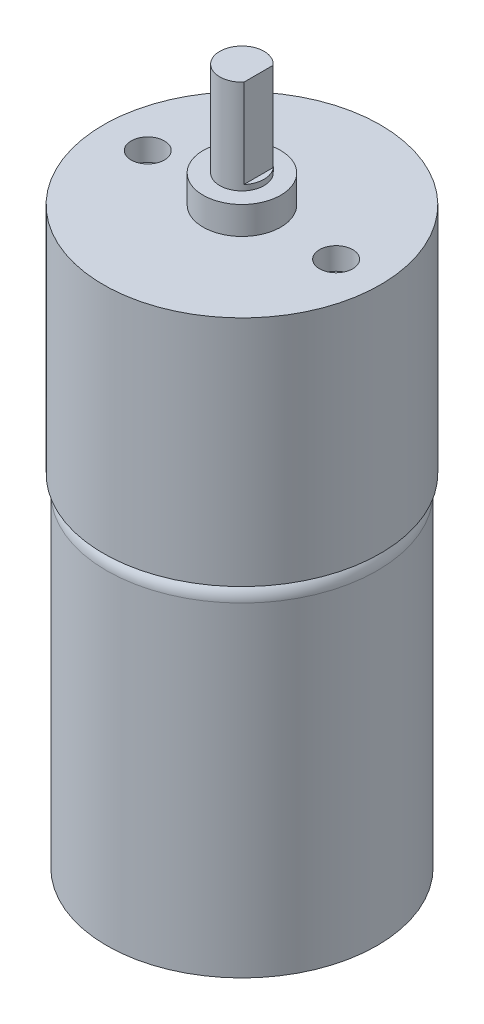
ISO-10303-21;
HEADER;
FILE_DESCRIPTION(('STEP AP214'),'2;1');
FILE_NAME('part.step','',(''),(''),'','','');
FILE_SCHEMA(('AUTOMOTIVE_DESIGN { 1 0 10303 214 1 1 1 1 }'));
ENDSEC;
DATA;
#1=APPLICATION_CONTEXT('core data for automotive mechanical design processes');
#2=APPLICATION_PROTOCOL_DEFINITION('international standard','automotive_design',2000,#1);
#3=PRODUCT_CONTEXT('',#1,'mechanical');
#4=PRODUCT('Part','Part','',(#3));
#5=PRODUCT_RELATED_PRODUCT_CATEGORY('part','',(#4));
#6=PRODUCT_DEFINITION_FORMATION('','',#4);
#7=PRODUCT_DEFINITION_CONTEXT('part definition',#1,'design');
#8=PRODUCT_DEFINITION('design','',#6,#7);
#9=PRODUCT_DEFINITION_SHAPE('','',#8);
#10=(LENGTH_UNIT() NAMED_UNIT(*) SI_UNIT(.MILLI.,.METRE.));
#11=(NAMED_UNIT(*) PLANE_ANGLE_UNIT() SI_UNIT($,.RADIAN.));
#12=(NAMED_UNIT(*) SI_UNIT($,.STERADIAN.) SOLID_ANGLE_UNIT());
#13=UNCERTAINTY_MEASURE_WITH_UNIT(LENGTH_MEASURE(1.E-05),#10,'distance_accuracy_value','');
#14=(GEOMETRIC_REPRESENTATION_CONTEXT(3) GLOBAL_UNCERTAINTY_ASSIGNED_CONTEXT((#13)) GLOBAL_UNIT_ASSIGNED_CONTEXT((#10,
#11,#12)) REPRESENTATION_CONTEXT('',''));
#15=CARTESIAN_POINT('',(0.,0.,0.));
#16=DIRECTION('',(0.,0.,1.));
#17=DIRECTION('',(1.,0.,0.));
#18=AXIS2_PLACEMENT_3D('',#15,#16,#17);
#19=CARTESIAN_POINT('',(0.,0.,0.));
#20=DIRECTION('',(0.,-1.,0.));
#21=DIRECTION('',(0.,0.,-1.));
#22=AXIS2_PLACEMENT_3D('',#19,#20,#21);
#23=PLANE('',#22);
#24=CARTESIAN_POINT('',(0.,0.,0.));
#25=DIRECTION('',(0.,-1.,0.));
#26=DIRECTION('',(0.,0.,-1.));
#27=AXIS2_PLACEMENT_3D('',#24,#25,#26);
#28=CIRCLE('',#27,3.25);
#29=CARTESIAN_POINT('',(0.,0.,-3.25));
#30=VERTEX_POINT('',#29);
#31=EDGE_CURVE('E11',#30,#30,#28,.T.);
#32=ORIENTED_EDGE('',*,*,#31,.T.);
#33=EDGE_LOOP('',(#32));
#34=FACE_BOUND('',#33,.T.);
#35=ADVANCED_FACE('F33',(#34),#23,.T.);
#36=CARTESIAN_POINT('',(0.,0.,0.));
#37=DIRECTION('',(0.,-1.,0.));
#38=DIRECTION('',(0.,0.,-1.));
#39=AXIS2_PLACEMENT_3D('',#36,#37,#38);
#40=CYLINDRICAL_SURFACE('',#39,3.25);
#41=CARTESIAN_POINT('',(0.,2.,0.));
#42=DIRECTION('',(0.,-1.,0.));
#43=DIRECTION('',(0.,0.,-1.));
#44=AXIS2_PLACEMENT_3D('',#41,#42,#43);
#45=CIRCLE('',#44,3.25);
#46=CARTESIAN_POINT('',(0.,2.,-3.25));
#47=VERTEX_POINT('',#46);
#48=EDGE_CURVE('E40',#47,#47,#45,.T.);
#49=ORIENTED_EDGE('',*,*,#48,.T.);
#50=EDGE_LOOP('',(#49));
#51=FACE_BOUND('',#50,.T.);
#52=ORIENTED_EDGE('',*,*,#31,.F.);
#53=EDGE_LOOP('',(#52));
#54=FACE_BOUND('',#53,.T.);
#55=ADVANCED_FACE('F102',(#51,#54),#40,.T.);
#56=CARTESIAN_POINT('',(3.25,2.,0.));
#57=DIRECTION('',(0.,-1.,0.));
#58=DIRECTION('',(0.,0.,-1.));
#59=AXIS2_PLACEMENT_3D('',#56,#57,#58);
#60=PLANE('',#59);
#61=CARTESIAN_POINT('',(0.,2.,0.));
#62=DIRECTION('',(0.,-1.,0.));
#63=DIRECTION('',(0.,0.,-1.));
#64=AXIS2_PLACEMENT_3D('',#61,#62,#63);
#65=CIRCLE('',#64,12.2);
#66=CARTESIAN_POINT('',(0.,2.,-12.2));
#67=VERTEX_POINT('',#66);
#68=EDGE_CURVE('E97',#67,#67,#65,.T.);
#69=ORIENTED_EDGE('',*,*,#68,.T.);
#70=EDGE_LOOP('',(#69));
#71=FACE_BOUND('',#70,.T.);
#72=ORIENTED_EDGE('',*,*,#48,.F.);
#73=EDGE_LOOP('',(#72));
#74=FACE_BOUND('',#73,.T.);
#75=ADVANCED_FACE('F105',(#71,#74),#60,.T.);
#76=CARTESIAN_POINT('',(0.,0.,0.));
#77=DIRECTION('',(0.,-1.,0.));
#78=DIRECTION('',(0.,0.,-1.));
#79=AXIS2_PLACEMENT_3D('',#76,#77,#78);
#80=CYLINDRICAL_SURFACE('',#79,12.2);
#81=CARTESIAN_POINT('',(0.,31.3,0.));
#82=DIRECTION('',(0.,-1.,0.));
#83=DIRECTION('',(0.,0.,-1.));
#84=AXIS2_PLACEMENT_3D('',#81,#82,#83);
#85=CIRCLE('',#84,12.2);
#86=CARTESIAN_POINT('',(0.,31.3,-12.2));
#87=VERTEX_POINT('',#86);
#88=EDGE_CURVE('E94',#87,#87,#85,.T.);
#89=ORIENTED_EDGE('',*,*,#88,.T.);
#90=EDGE_LOOP('',(#89));
#91=FACE_BOUND('',#90,.T.);
#92=ORIENTED_EDGE('',*,*,#68,.F.);
#93=EDGE_LOOP('',(#92));
#94=FACE_BOUND('',#93,.T.);
#95=ADVANCED_FACE('F107',(#91,#94),#80,.T.);
#96=CARTESIAN_POINT('',(0.,31.3,0.));
#97=DIRECTION('',(0.,-1.,0.));
#98=DIRECTION('',(0.,0.,-1.));
#99=AXIS2_PLACEMENT_3D('',#96,#97,#98);
#100=TOROIDAL_SURFACE('',#99,10.7,1.5);
#101=CARTESIAN_POINT('',(0.,32.8,0.));
#102=DIRECTION('',(0.,-1.,0.));
#103=DIRECTION('',(0.,0.,-1.));
#104=AXIS2_PLACEMENT_3D('',#101,#102,#103);
#105=CIRCLE('',#104,10.7);
#106=CARTESIAN_POINT('',(0.,32.8,-10.7));
#107=VERTEX_POINT('',#106);
#108=EDGE_CURVE('E91',#107,#107,#105,.T.);
#109=ORIENTED_EDGE('',*,*,#108,.T.);
#110=EDGE_LOOP('',(#109));
#111=FACE_BOUND('',#110,.T.);
#112=ORIENTED_EDGE('',*,*,#88,.F.);
#113=EDGE_LOOP('',(#112));
#114=FACE_BOUND('',#113,.T.);
#115=ADVANCED_FACE('F114',(#111,#114),#100,.T.);
#116=CARTESIAN_POINT('',(10.7,32.8,0.));
#117=DIRECTION('',(0.,-1.,0.));
#118=DIRECTION('',(0.,0.,-1.));
#119=AXIS2_PLACEMENT_3D('',#116,#117,#118);
#120=PLANE('',#119);
#121=CARTESIAN_POINT('',(0.,32.8,0.));
#122=DIRECTION('',(0.,-1.,0.));
#123=DIRECTION('',(0.,0.,-1.));
#124=AXIS2_PLACEMENT_3D('',#121,#122,#123);
#125=CIRCLE('',#124,12.5);
#126=CARTESIAN_POINT('',(0.,32.8,-12.5));
#127=VERTEX_POINT('',#126);
#128=EDGE_CURVE('E88',#127,#127,#125,.T.);
#129=ORIENTED_EDGE('',*,*,#128,.T.);
#130=EDGE_LOOP('',(#129));
#131=FACE_BOUND('',#130,.T.);
#132=ORIENTED_EDGE('',*,*,#108,.F.);
#133=EDGE_LOOP('',(#132));
#134=FACE_BOUND('',#133,.T.);
#135=ADVANCED_FACE('F145',(#131,#134),#120,.T.);
#136=CARTESIAN_POINT('',(0.,0.,0.));
#137=DIRECTION('',(0.,-1.,0.));
#138=DIRECTION('',(0.,0.,-1.));
#139=AXIS2_PLACEMENT_3D('',#136,#137,#138);
#140=CYLINDRICAL_SURFACE('',#139,12.5);
#141=CARTESIAN_POINT('',(0.,53.8,0.));
#142=DIRECTION('',(0.,-1.,0.));
#143=DIRECTION('',(0.,0.,-1.));
#144=AXIS2_PLACEMENT_3D('',#141,#142,#143);
#145=CIRCLE('',#144,12.5);
#146=CARTESIAN_POINT('',(0.,53.8,-12.5));
#147=VERTEX_POINT('',#146);
#148=EDGE_CURVE('E85',#147,#147,#145,.T.);
#149=ORIENTED_EDGE('',*,*,#148,.T.);
#150=EDGE_LOOP('',(#149));
#151=FACE_BOUND('',#150,.T.);
#152=ORIENTED_EDGE('',*,*,#128,.F.);
#153=EDGE_LOOP('',(#152));
#154=FACE_BOUND('',#153,.T.);
#155=ADVANCED_FACE('F155',(#151,#154),#140,.T.);
#156=CARTESIAN_POINT('',(12.5,53.8,0.));
#157=DIRECTION('',(0.,1.,0.));
#158=DIRECTION('',(0.,0.,1.));
#159=AXIS2_PLACEMENT_3D('',#156,#157,#158);
#160=PLANE('',#159);
#161=CARTESIAN_POINT('',(8.5,53.8,0.));
#162=DIRECTION('',(0.,1.,0.));
#163=DIRECTION('',(0.,0.,1.));
#164=AXIS2_PLACEMENT_3D('',#161,#162,#163);
#165=CIRCLE('',#164,1.5);
#166=CARTESIAN_POINT('',(8.5,53.8,1.5));
#167=VERTEX_POINT('',#166);
#168=EDGE_CURVE('E273',#167,#167,#165,.T.);
#169=ORIENTED_EDGE('',*,*,#168,.F.);
#170=EDGE_LOOP('',(#169));
#171=FACE_BOUND('',#170,.T.);
#172=CARTESIAN_POINT('',(-8.5,53.8,0.));
#173=DIRECTION('',(0.,1.,0.));
#174=DIRECTION('',(0.,0.,-1.));
#175=AXIS2_PLACEMENT_3D('',#172,#173,#174);
#176=CIRCLE('',#175,1.5);
#177=CARTESIAN_POINT('',(-8.5,53.8,-1.5));
#178=VERTEX_POINT('',#177);
#179=EDGE_CURVE('E281',#178,#178,#176,.T.);
#180=ORIENTED_EDGE('',*,*,#179,.F.);
#181=EDGE_LOOP('',(#180));
#182=FACE_BOUND('',#181,.T.);
#183=CARTESIAN_POINT('',(0.,53.8,0.));
#184=DIRECTION('',(0.,-1.,0.));
#185=DIRECTION('',(0.,0.,-1.));
#186=AXIS2_PLACEMENT_3D('',#183,#184,#185);
#187=CIRCLE('',#186,3.5);
#188=CARTESIAN_POINT('',(0.,53.8,-3.5));
#189=VERTEX_POINT('',#188);
#190=EDGE_CURVE('E82',#189,#189,#187,.T.);
#191=ORIENTED_EDGE('',*,*,#190,.T.);
#192=EDGE_LOOP('',(#191));
#193=FACE_BOUND('',#192,.T.);
#194=ORIENTED_EDGE('',*,*,#148,.F.);
#195=EDGE_LOOP('',(#194));
#196=FACE_BOUND('',#195,.T.);
#197=ADVANCED_FACE('F165',(#171,#182,#193,#196),#160,.T.);
#198=CARTESIAN_POINT('',(0.,0.,0.));
#199=DIRECTION('',(0.,-1.,0.));
#200=DIRECTION('',(0.,0.,-1.));
#201=AXIS2_PLACEMENT_3D('',#198,#199,#200);
#202=CYLINDRICAL_SURFACE('',#201,3.5);
#203=CARTESIAN_POINT('',(0.,56.3,0.));
#204=DIRECTION('',(0.,-1.,0.));
#205=DIRECTION('',(0.,0.,-1.));
#206=AXIS2_PLACEMENT_3D('',#203,#204,#205);
#207=CIRCLE('',#206,3.5);
#208=CARTESIAN_POINT('',(0.,56.3,-3.5));
#209=VERTEX_POINT('',#208);
#210=EDGE_CURVE('E76',#209,#209,#207,.T.);
#211=ORIENTED_EDGE('',*,*,#210,.T.);
#212=EDGE_LOOP('',(#211));
#213=FACE_BOUND('',#212,.T.);
#214=ORIENTED_EDGE('',*,*,#190,.F.);
#215=EDGE_LOOP('',(#214));
#216=FACE_BOUND('',#215,.T.);
#217=ADVANCED_FACE('F173',(#213,#216),#202,.T.);
#218=CARTESIAN_POINT('',(3.5,56.3,0.));
#219=DIRECTION('',(0.,1.,0.));
#220=DIRECTION('',(0.,0.,1.));
#221=AXIS2_PLACEMENT_3D('',#218,#219,#220);
#222=PLANE('',#221);
#223=CARTESIAN_POINT('',(0.,56.3,0.));
#224=DIRECTION('',(0.,-1.,0.));
#225=DIRECTION('',(0.,0.,-1.));
#226=AXIS2_PLACEMENT_3D('',#223,#224,#225);
#227=CIRCLE('',#226,2.);
#228=CARTESIAN_POINT('',(0.,56.3,-2.));
#229=VERTEX_POINT('',#228);
#230=EDGE_CURVE('E73',#229,#229,#227,.T.);
#231=ORIENTED_EDGE('',*,*,#230,.T.);
#232=EDGE_LOOP('',(#231));
#233=FACE_BOUND('',#232,.T.);
#234=ORIENTED_EDGE('',*,*,#210,.F.);
#235=EDGE_LOOP('',(#234));
#236=FACE_BOUND('',#235,.T.);
#237=ADVANCED_FACE('F178',(#233,#236),#222,.T.);
#238=CARTESIAN_POINT('',(0.,0.,0.));
#239=DIRECTION('',(0.,-1.,0.));
#240=DIRECTION('',(0.,0.,-1.));
#241=AXIS2_PLACEMENT_3D('',#238,#239,#240);
#242=CYLINDRICAL_SURFACE('',#241,2.);
#243=DIRECTION('',(0.,1.,0.));
#244=VECTOR('',#243,1.);
#245=CARTESIAN_POINT('',(1.5,56.8,-1.3228756555323));
#246=LINE('',#245,#244);
#247=CARTESIAN_POINT('',(1.5,56.8,-1.3228756555323));
#248=VERTEX_POINT('',#247);
#249=CARTESIAN_POINT('',(1.5,64.8,-1.3228756555323));
#250=VERTEX_POINT('',#249);
#251=EDGE_CURVE('E47',#248,#250,#246,.T.);
#252=ORIENTED_EDGE('',*,*,#251,.F.);
#253=CARTESIAN_POINT('',(0.,56.8,0.));
#254=DIRECTION('',(0.,1.,0.));
#255=DIRECTION('',(0.,0.,1.));
#256=AXIS2_PLACEMENT_3D('',#253,#254,#255);
#257=CIRCLE('',#256,2.);
#258=CARTESIAN_POINT('',(1.5,56.8,1.3228756555323));
#259=VERTEX_POINT('',#258);
#260=EDGE_CURVE('E63',#259,#248,#257,.T.);
#261=ORIENTED_EDGE('',*,*,#260,.F.);
#262=DIRECTION('',(0.,1.,0.));
#263=VECTOR('',#262,1.);
#264=CARTESIAN_POINT('',(1.5,56.8,1.3228756555323));
#265=LINE('',#264,#263);
#266=CARTESIAN_POINT('',(1.5,64.8,1.3228756555323));
#267=VERTEX_POINT('',#266);
#268=EDGE_CURVE('E53',#259,#267,#265,.T.);
#269=ORIENTED_EDGE('',*,*,#268,.T.);
#270=CARTESIAN_POINT('',(0.,64.8,0.));
#271=DIRECTION('',(0.,-1.,0.));
#272=DIRECTION('',(0.,0.,-1.));
#273=AXIS2_PLACEMENT_3D('',#270,#271,#272);
#274=CIRCLE('',#273,2.);
#275=EDGE_CURVE('E70',#267,#250,#274,.T.);
#276=ORIENTED_EDGE('',*,*,#275,.T.);
#277=EDGE_LOOP('',(#252,#261,#269,#276));
#278=FACE_BOUND('',#277,.T.);
#279=ORIENTED_EDGE('',*,*,#230,.F.);
#280=EDGE_LOOP('',(#279));
#281=FACE_BOUND('',#280,.T.);
#282=ADVANCED_FACE('F68',(#278,#281),#242,.T.);
#283=CARTESIAN_POINT('',(2.,64.8,0.));
#284=DIRECTION('',(0.,1.,0.));
#285=DIRECTION('',(0.,0.,1.));
#286=AXIS2_PLACEMENT_3D('',#283,#284,#285);
#287=PLANE('',#286);
#288=DIRECTION('',(0.,0.,1.));
#289=VECTOR('',#288,1.);
#290=CARTESIAN_POINT('',(1.5,64.8,-1.3228756555323));
#291=LINE('',#290,#289);
#292=EDGE_CURVE('E58',#250,#267,#291,.T.);
#293=ORIENTED_EDGE('',*,*,#292,.F.);
#294=ORIENTED_EDGE('',*,*,#275,.F.);
#295=EDGE_LOOP('',(#293,#294));
#296=FACE_BOUND('',#295,.T.);
#297=ADVANCED_FACE('F72',(#296),#287,.T.);
#298=CARTESIAN_POINT('',(1.5,56.8,-1.3228756555323));
#299=DIRECTION('',(-1.,0.,0.));
#300=DIRECTION('',(0.,0.,1.));
#301=AXIS2_PLACEMENT_3D('',#298,#299,#300);
#302=PLANE('',#301);
#303=ORIENTED_EDGE('',*,*,#292,.T.);
#304=ORIENTED_EDGE('',*,*,#268,.F.);
#305=DIRECTION('',(0.,0.,1.));
#306=VECTOR('',#305,1.);
#307=CARTESIAN_POINT('',(1.5,56.8,-1.3228756555323));
#308=LINE('',#307,#306);
#309=EDGE_CURVE('E285',#248,#259,#308,.T.);
#310=ORIENTED_EDGE('',*,*,#309,.F.);
#311=ORIENTED_EDGE('',*,*,#251,.T.);
#312=EDGE_LOOP('',(#303,#304,#310,#311));
#313=FACE_BOUND('',#312,.T.);
#314=ADVANCED_FACE('F59',(#313),#302,.F.);
#315=CARTESIAN_POINT('',(0.,56.8,0.));
#316=DIRECTION('',(0.,1.,0.));
#317=DIRECTION('',(0.,0.,1.));
#318=AXIS2_PLACEMENT_3D('',#315,#316,#317);
#319=PLANE('',#318);
#320=ORIENTED_EDGE('',*,*,#260,.T.);
#321=ORIENTED_EDGE('',*,*,#309,.T.);
#322=EDGE_LOOP('',(#320,#321));
#323=FACE_BOUND('',#322,.T.);
#324=ADVANCED_FACE('F213',(#323),#319,.T.);
#325=CARTESIAN_POINT('',(-8.5,51.8,0.));
#326=DIRECTION('',(0.,1.,0.));
#327=DIRECTION('',(0.,0.,1.));
#328=AXIS2_PLACEMENT_3D('',#325,#326,#327);
#329=CYLINDRICAL_SURFACE('',#328,1.5);
#330=CARTESIAN_POINT('',(-8.5,51.8,0.));
#331=DIRECTION('',(0.,1.,0.));
#332=DIRECTION('',(0.,0.,-1.));
#333=AXIS2_PLACEMENT_3D('',#330,#331,#332);
#334=CIRCLE('',#333,1.5);
#335=CARTESIAN_POINT('',(-8.5,51.8,-1.5));
#336=VERTEX_POINT('',#335);
#337=EDGE_CURVE('E276',#336,#336,#334,.T.);
#338=ORIENTED_EDGE('',*,*,#337,.F.);
#339=EDGE_LOOP('',(#338));
#340=FACE_BOUND('',#339,.T.);
#341=ORIENTED_EDGE('',*,*,#179,.T.);
#342=EDGE_LOOP('',(#341));
#343=FACE_BOUND('',#342,.T.);
#344=ADVANCED_FACE('F222',(#340,#343),#329,.F.);
#345=CARTESIAN_POINT('',(-8.5,51.8,0.));
#346=DIRECTION('',(0.,-1.,0.));
#347=DIRECTION('',(0.,0.,-1.));
#348=AXIS2_PLACEMENT_3D('',#345,#346,#347);
#349=PLANE('',#348);
#350=ORIENTED_EDGE('',*,*,#337,.T.);
#351=EDGE_LOOP('',(#350));
#352=FACE_BOUND('',#351,.T.);
#353=ADVANCED_FACE('F237',(#352),#349,.F.);
#354=CARTESIAN_POINT('',(8.5,51.8,0.));
#355=DIRECTION('',(0.,1.,0.));
#356=DIRECTION('',(0.,0.,1.));
#357=AXIS2_PLACEMENT_3D('',#354,#355,#356);
#358=CYLINDRICAL_SURFACE('',#357,1.5);
#359=CARTESIAN_POINT('',(8.5,51.8,0.));
#360=DIRECTION('',(0.,1.,0.));
#361=DIRECTION('',(0.,0.,1.));
#362=AXIS2_PLACEMENT_3D('',#359,#360,#361);
#363=CIRCLE('',#362,1.5);
#364=CARTESIAN_POINT('',(8.5,51.8,1.5));
#365=VERTEX_POINT('',#364);
#366=EDGE_CURVE('E64',#365,#365,#363,.T.);
#367=ORIENTED_EDGE('',*,*,#366,.F.);
#368=EDGE_LOOP('',(#367));
#369=FACE_BOUND('',#368,.T.);
#370=ORIENTED_EDGE('',*,*,#168,.T.);
#371=EDGE_LOOP('',(#370));
#372=FACE_BOUND('',#371,.T.);
#373=ADVANCED_FACE('F247',(#369,#372),#358,.F.);
#374=CARTESIAN_POINT('',(8.5,51.8,0.));
#375=DIRECTION('',(0.,1.,0.));
#376=DIRECTION('',(0.,0.,1.));
#377=AXIS2_PLACEMENT_3D('',#374,#375,#376);
#378=PLANE('',#377);
#379=ORIENTED_EDGE('',*,*,#366,.T.);
#380=EDGE_LOOP('',(#379));
#381=FACE_BOUND('',#380,.T.);
#382=ADVANCED_FACE('F257',(#381),#378,.T.);
#383=CLOSED_SHELL('',(#35,#55,#75,#95,#115,#135,#155,#197,#217,#237,#282,#297,#314,#324,#344,
#353,#373,#382));
#384=MANIFOLD_SOLID_BREP('B2',#383);
#385=ADVANCED_BREP_SHAPE_REPRESENTATION('',(#18,#384),#14);
#386=SHAPE_DEFINITION_REPRESENTATION(#9,#385);
ENDSEC;
END-ISO-10303-21;
